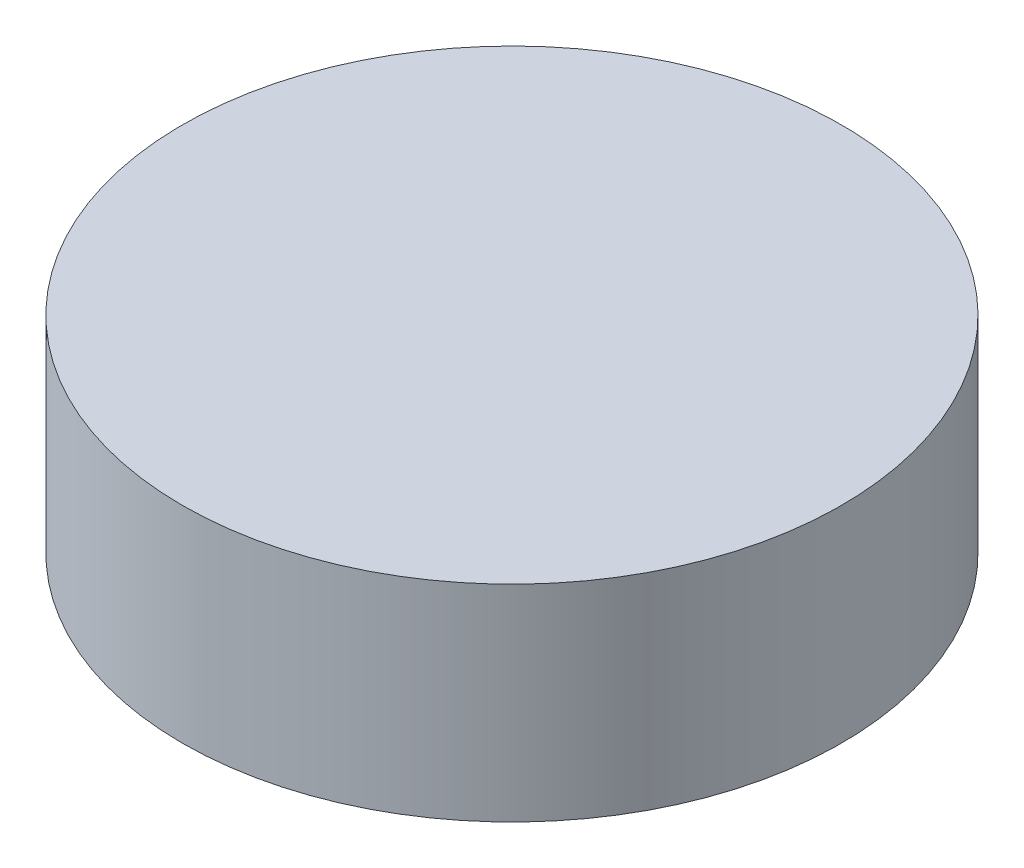
ISO-10303-21;
HEADER;
FILE_DESCRIPTION(('STEP AP214'),'2;1');
FILE_NAME('part.step','',(''),(''),'','','');
FILE_SCHEMA(('AUTOMOTIVE_DESIGN { 1 0 10303 214 1 1 1 1 }'));
ENDSEC;
DATA;
#1=APPLICATION_CONTEXT('core data for automotive mechanical design processes');
#2=APPLICATION_PROTOCOL_DEFINITION('international standard','automotive_design',2000,#1);
#3=PRODUCT_CONTEXT('',#1,'mechanical');
#4=PRODUCT('Part','Part','',(#3));
#5=PRODUCT_RELATED_PRODUCT_CATEGORY('part','',(#4));
#6=PRODUCT_DEFINITION_FORMATION('','',#4);
#7=PRODUCT_DEFINITION_CONTEXT('part definition',#1,'design');
#8=PRODUCT_DEFINITION('design','',#6,#7);
#9=PRODUCT_DEFINITION_SHAPE('','',#8);
#10=(LENGTH_UNIT() NAMED_UNIT(*) SI_UNIT(.MILLI.,.METRE.));
#11=(NAMED_UNIT(*) PLANE_ANGLE_UNIT() SI_UNIT($,.RADIAN.));
#12=(NAMED_UNIT(*) SI_UNIT($,.STERADIAN.) SOLID_ANGLE_UNIT());
#13=UNCERTAINTY_MEASURE_WITH_UNIT(LENGTH_MEASURE(1.E-05),#10,'distance_accuracy_value','');
#14=(GEOMETRIC_REPRESENTATION_CONTEXT(3) GLOBAL_UNCERTAINTY_ASSIGNED_CONTEXT((#13)) GLOBAL_UNIT_ASSIGNED_CONTEXT((#10,
#11,#12)) REPRESENTATION_CONTEXT('',''));
#15=CARTESIAN_POINT('',(0.,0.,0.));
#16=DIRECTION('',(0.,0.,1.));
#17=DIRECTION('',(1.,0.,0.));
#18=AXIS2_PLACEMENT_3D('',#15,#16,#17);
#19=CARTESIAN_POINT('',(0.,2.5,0.));
#20=DIRECTION('',(0.,-1.,0.));
#21=DIRECTION('',(0.,0.,-1.));
#22=AXIS2_PLACEMENT_3D('',#19,#20,#21);
#23=CYLINDRICAL_SURFACE('',#22,4.);
#24=CARTESIAN_POINT('',(0.,2.5,0.));
#25=DIRECTION('',(0.,1.,0.));
#26=DIRECTION('',(0.,0.,1.));
#27=AXIS2_PLACEMENT_3D('',#24,#25,#26);
#28=CIRCLE('',#27,4.);
#29=CARTESIAN_POINT('',(0.,2.5,4.));
#30=VERTEX_POINT('',#29);
#31=EDGE_CURVE('E10',#30,#30,#28,.T.);
#32=ORIENTED_EDGE('',*,*,#31,.F.);
#33=EDGE_LOOP('',(#32));
#34=FACE_BOUND('',#33,.T.);
#35=CARTESIAN_POINT('',(0.,0.,0.));
#36=DIRECTION('',(0.,1.,0.));
#37=DIRECTION('',(0.,0.,1.));
#38=AXIS2_PLACEMENT_3D('',#35,#36,#37);
#39=CIRCLE('',#38,4.);
#40=CARTESIAN_POINT('',(0.,0.,4.));
#41=VERTEX_POINT('',#40);
#42=EDGE_CURVE('E36',#41,#41,#39,.T.);
#43=ORIENTED_EDGE('',*,*,#42,.T.);
#44=EDGE_LOOP('',(#43));
#45=FACE_BOUND('',#44,.T.);
#46=ADVANCED_FACE('F33',(#34,#45),#23,.T.);
#47=CARTESIAN_POINT('',(0.,2.5,0.));
#48=DIRECTION('',(0.,1.,0.));
#49=DIRECTION('',(0.,0.,1.));
#50=AXIS2_PLACEMENT_3D('',#47,#48,#49);
#51=PLANE('',#50);
#52=ORIENTED_EDGE('',*,*,#31,.T.);
#53=EDGE_LOOP('',(#52));
#54=FACE_BOUND('',#53,.T.);
#55=ADVANCED_FACE('F48',(#54),#51,.T.);
#56=CARTESIAN_POINT('',(0.,0.,0.));
#57=DIRECTION('',(0.,1.,0.));
#58=DIRECTION('',(0.,0.,1.));
#59=AXIS2_PLACEMENT_3D('',#56,#57,#58);
#60=PLANE('',#59);
#61=ORIENTED_EDGE('',*,*,#42,.F.);
#62=EDGE_LOOP('',(#61));
#63=FACE_BOUND('',#62,.T.);
#64=ADVANCED_FACE('F46',(#63),#60,.F.);
#65=CLOSED_SHELL('',(#46,#55,#64));
#66=MANIFOLD_SOLID_BREP('B2',#65);
#67=ADVANCED_BREP_SHAPE_REPRESENTATION('',(#18,#66),#14);
#68=SHAPE_DEFINITION_REPRESENTATION(#9,#67);
ENDSEC;
END-ISO-10303-21;
